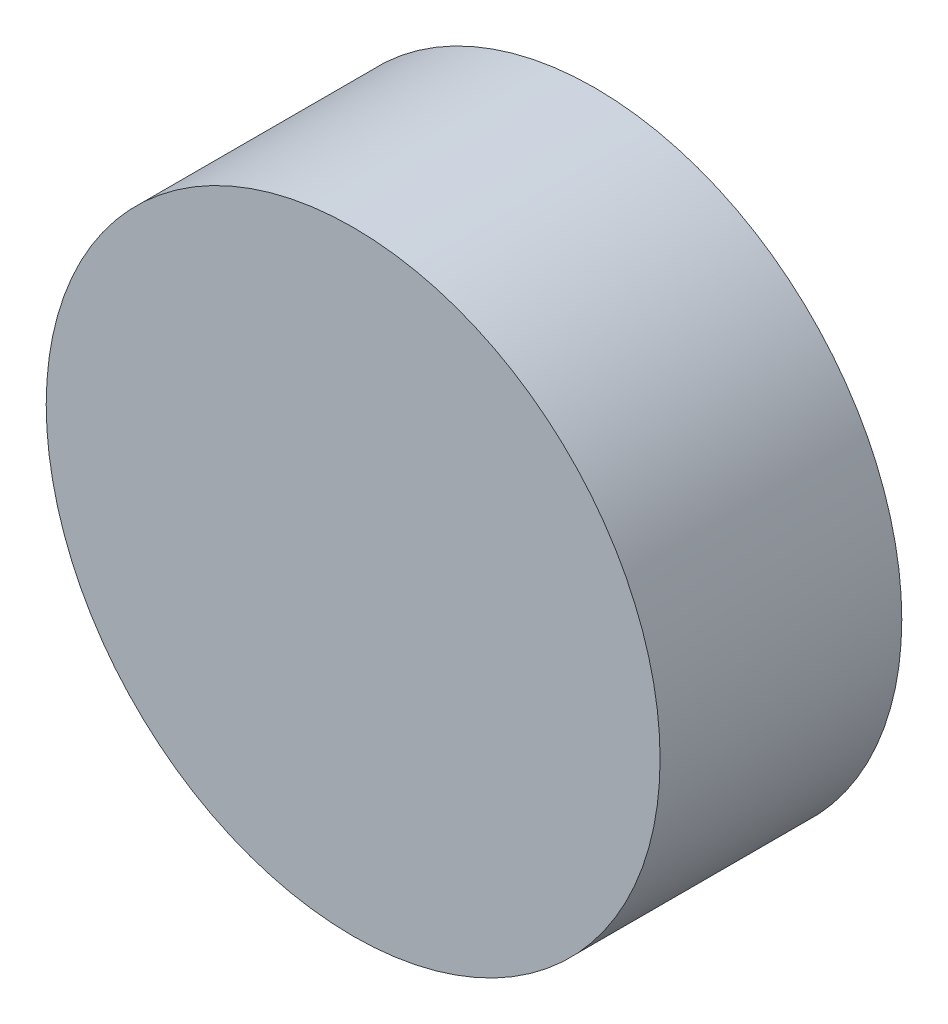
ISO-10303-21;
HEADER;
FILE_DESCRIPTION(('STEP AP214'),'2;1');
FILE_NAME('part.step','',(''),(''),'','','');
FILE_SCHEMA(('AUTOMOTIVE_DESIGN { 1 0 10303 214 1 1 1 1 }'));
ENDSEC;
DATA;
#1=APPLICATION_CONTEXT('core data for automotive mechanical design processes');
#2=APPLICATION_PROTOCOL_DEFINITION('international standard','automotive_design',2000,#1);
#3=PRODUCT_CONTEXT('',#1,'mechanical');
#4=PRODUCT('Part','Part','',(#3));
#5=PRODUCT_RELATED_PRODUCT_CATEGORY('part','',(#4));
#6=PRODUCT_DEFINITION_FORMATION('','',#4);
#7=PRODUCT_DEFINITION_CONTEXT('part definition',#1,'design');
#8=PRODUCT_DEFINITION('design','',#6,#7);
#9=PRODUCT_DEFINITION_SHAPE('','',#8);
#10=(LENGTH_UNIT() NAMED_UNIT(*) SI_UNIT(.MILLI.,.METRE.));
#11=(NAMED_UNIT(*) PLANE_ANGLE_UNIT() SI_UNIT($,.RADIAN.));
#12=(NAMED_UNIT(*) SI_UNIT($,.STERADIAN.) SOLID_ANGLE_UNIT());
#13=UNCERTAINTY_MEASURE_WITH_UNIT(LENGTH_MEASURE(1.E-05),#10,'distance_accuracy_value','');
#14=(GEOMETRIC_REPRESENTATION_CONTEXT(3) GLOBAL_UNCERTAINTY_ASSIGNED_CONTEXT((#13)) GLOBAL_UNIT_ASSIGNED_CONTEXT((#10,
#11,#12)) REPRESENTATION_CONTEXT('',''));
#15=CARTESIAN_POINT('',(0.,0.,0.));
#16=DIRECTION('',(0.,0.,1.));
#17=DIRECTION('',(1.,0.,0.));
#18=AXIS2_PLACEMENT_3D('',#15,#16,#17);
#19=CARTESIAN_POINT('',(0.,0.,40.));
#20=DIRECTION('',(0.,0.,-1.));
#21=DIRECTION('',(-1.,0.,0.));
#22=AXIS2_PLACEMENT_3D('',#19,#20,#21);
#23=CYLINDRICAL_SURFACE('',#22,101.6);
#24=CARTESIAN_POINT('',(0.,0.,40.));
#25=DIRECTION('',(0.,0.,1.));
#26=DIRECTION('',(1.,0.,0.));
#27=AXIS2_PLACEMENT_3D('',#24,#25,#26);
#28=CIRCLE('',#27,101.6);
#29=CARTESIAN_POINT('',(101.6,0.,40.));
#30=VERTEX_POINT('',#29);
#31=EDGE_CURVE('E10',#30,#30,#28,.T.);
#32=ORIENTED_EDGE('',*,*,#31,.F.);
#33=EDGE_LOOP('',(#32));
#34=FACE_BOUND('',#33,.T.);
#35=CARTESIAN_POINT('',(0.,0.,-40.));
#36=DIRECTION('',(0.,0.,1.));
#37=DIRECTION('',(1.,0.,0.));
#38=AXIS2_PLACEMENT_3D('',#35,#36,#37);
#39=CIRCLE('',#38,101.6);
#40=CARTESIAN_POINT('',(101.6,0.,-40.));
#41=VERTEX_POINT('',#40);
#42=EDGE_CURVE('E34',#41,#41,#39,.T.);
#43=ORIENTED_EDGE('',*,*,#42,.T.);
#44=EDGE_LOOP('',(#43));
#45=FACE_BOUND('',#44,.T.);
#46=ADVANCED_FACE('F31',(#34,#45),#23,.T.);
#47=CARTESIAN_POINT('',(0.,0.,40.));
#48=DIRECTION('',(0.,0.,1.));
#49=DIRECTION('',(1.,0.,0.));
#50=AXIS2_PLACEMENT_3D('',#47,#48,#49);
#51=PLANE('',#50);
#52=ORIENTED_EDGE('',*,*,#31,.T.);
#53=EDGE_LOOP('',(#52));
#54=FACE_BOUND('',#53,.T.);
#55=ADVANCED_FACE('F46',(#54),#51,.T.);
#56=CARTESIAN_POINT('',(0.,0.,-40.));
#57=DIRECTION('',(0.,0.,1.));
#58=DIRECTION('',(1.,0.,0.));
#59=AXIS2_PLACEMENT_3D('',#56,#57,#58);
#60=PLANE('',#59);
#61=ORIENTED_EDGE('',*,*,#42,.F.);
#62=EDGE_LOOP('',(#61));
#63=FACE_BOUND('',#62,.T.);
#64=ADVANCED_FACE('F44',(#63),#60,.F.);
#65=CLOSED_SHELL('',(#46,#55,#64));
#66=MANIFOLD_SOLID_BREP('B2',#65);
#67=ADVANCED_BREP_SHAPE_REPRESENTATION('',(#18,#66),#14);
#68=SHAPE_DEFINITION_REPRESENTATION(#9,#67);
ENDSEC;
END-ISO-10303-21;
